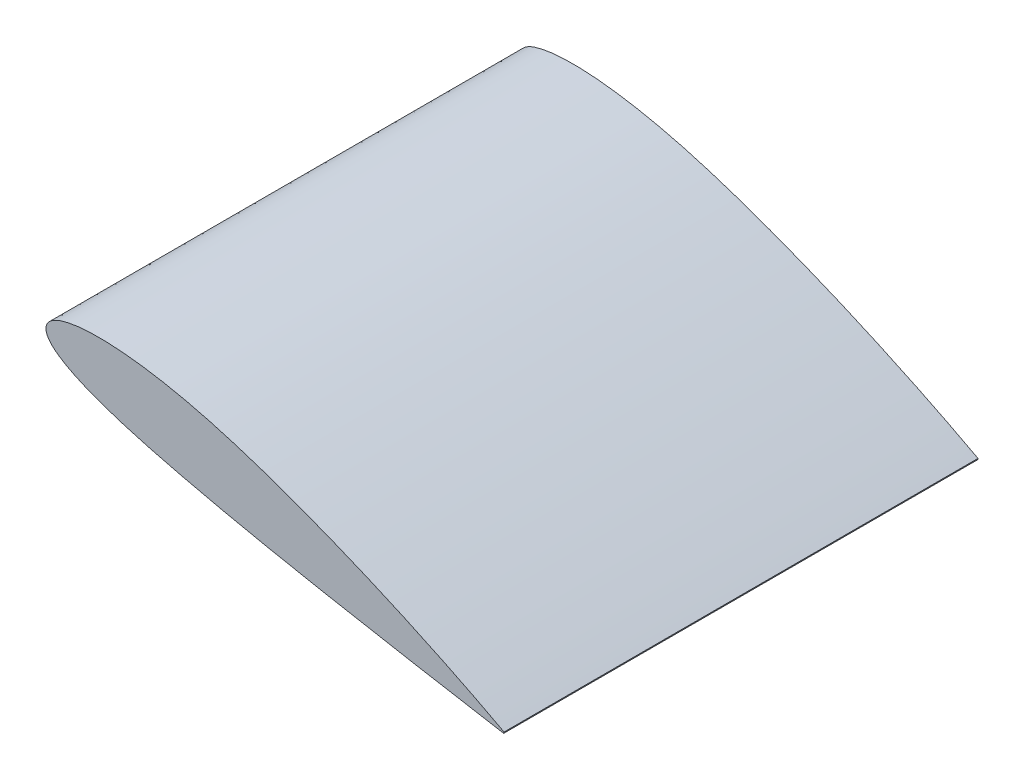
ISO-10303-21;
HEADER;
FILE_DESCRIPTION(('STEP AP214'),'2;1');
FILE_NAME('part.step','',(''),(''),'','','');
FILE_SCHEMA(('AUTOMOTIVE_DESIGN { 1 0 10303 214 1 1 1 1 }'));
ENDSEC;
DATA;
#1=APPLICATION_CONTEXT('core data for automotive mechanical design processes');
#2=APPLICATION_PROTOCOL_DEFINITION('international standard','automotive_design',2000,#1);
#3=PRODUCT_CONTEXT('',#1,'mechanical');
#4=PRODUCT('Part','Part','',(#3));
#5=PRODUCT_RELATED_PRODUCT_CATEGORY('part','',(#4));
#6=PRODUCT_DEFINITION_FORMATION('','',#4);
#7=PRODUCT_DEFINITION_CONTEXT('part definition',#1,'design');
#8=PRODUCT_DEFINITION('design','',#6,#7);
#9=PRODUCT_DEFINITION_SHAPE('','',#8);
#10=(LENGTH_UNIT() NAMED_UNIT(*) SI_UNIT(.MILLI.,.METRE.));
#11=(NAMED_UNIT(*) PLANE_ANGLE_UNIT() SI_UNIT($,.RADIAN.));
#12=(NAMED_UNIT(*) SI_UNIT($,.STERADIAN.) SOLID_ANGLE_UNIT());
#13=UNCERTAINTY_MEASURE_WITH_UNIT(LENGTH_MEASURE(1.E-05),#10,'distance_accuracy_value','');
#14=(GEOMETRIC_REPRESENTATION_CONTEXT(3) GLOBAL_UNCERTAINTY_ASSIGNED_CONTEXT((#13)) GLOBAL_UNIT_ASSIGNED_CONTEXT((#10,
#11,#12)) REPRESENTATION_CONTEXT('',''));
#15=CARTESIAN_POINT('',(0.,0.,0.));
#16=DIRECTION('',(0.,0.,1.));
#17=DIRECTION('',(1.,0.,0.));
#18=AXIS2_PLACEMENT_3D('',#15,#16,#17);
#19=CARTESIAN_POINT('',(500.380463996301,0.684910964644954,500.));
#20=CARTESIAN_POINT('',(499.9877618964,0.899476741979179,500.));
#21=CARTESIAN_POINT('',(498.379520002359,1.77819287877607,500.));
#22=CARTESIAN_POINT('',(494.724795459019,3.69339888968124,500.));
#23=CARTESIAN_POINT('',(488.668576117749,6.89473311279851,500.));
#24=CARTESIAN_POINT('',(480.253931871656,11.2693786013335,500.));
#25=CARTESIAN_POINT('',(469.572425637167,16.754502219723,500.));
#26=CARTESIAN_POINT('',(451.124700389354,26.0350933232045,500.));
#27=CARTESIAN_POINT('',(423.330265585062,39.5479179549738,500.));
#28=CARTESIAN_POINT('',(385.020236461234,57.2211427320324,500.));
#29=CARTESIAN_POINT('',(349.324231508166,72.6684479983427,500.));
#30=CARTESIAN_POINT('',(318.470794533771,85.2640702799098,500.));
#31=CARTESIAN_POINT('',(294.236154178482,94.739860643041,500.));
#32=CARTESIAN_POINT('',(269.581372847869,103.882526411277,500.));
#33=CARTESIAN_POINT('',(244.769860079252,112.56278107854,500.));
#34=CARTESIAN_POINT('',(219.993165082434,120.660650274886,500.));
#35=CARTESIAN_POINT('',(195.478965564054,127.907059723247,500.));
#36=CARTESIAN_POINT('',(171.487528336489,134.109047714543,500.));
#37=CARTESIAN_POINT('',(148.380181625974,139.184804352151,500.));
#38=CARTESIAN_POINT('',(126.430423416033,143.078422896195,500.));
#39=CARTESIAN_POINT('',(105.905312395121,145.788264466767,500.));
#40=CARTESIAN_POINT('',(87.0506403358911,147.299335084303,500.));
#41=CARTESIAN_POINT('',(70.0988614434825,147.683325605259,500.));
#42=CARTESIAN_POINT('',(55.2515724940028,146.986744575518,500.));
#43=CARTESIAN_POINT('',(42.6734428136375,145.312356719623,500.));
#44=CARTESIAN_POINT('',(32.4722091227457,142.737894506984,500.));
#45=CARTESIAN_POINT('',(24.7042670223328,139.32427240949,500.));
#46=CARTESIAN_POINT('',(19.3074252645258,134.987872262996,500.));
#47=CARTESIAN_POINT('',(16.7100941128866,129.467983342564,500.));
#48=CARTESIAN_POINT('',(17.4090111461147,123.419135392076,500.));
#49=CARTESIAN_POINT('',(21.0762841823266,117.590462904188,500.));
#50=CARTESIAN_POINT('',(27.212420899173,111.851854761809,500.));
#51=CARTESIAN_POINT('',(35.7912023833257,106.038418862578,500.));
#52=CARTESIAN_POINT('',(46.7650835700481,100.1760740178,500.));
#53=CARTESIAN_POINT('',(60.0355956372236,94.305073489301,500.));
#54=CARTESIAN_POINT('',(75.4576556821559,88.457417989138,500.));
#55=CARTESIAN_POINT('',(92.8710436286668,82.6769971294477,500.));
#56=CARTESIAN_POINT('',(112.084328552323,76.980504071494,500.));
#57=CARTESIAN_POINT('',(132.888183707331,71.3638384579801,500.));
#58=CARTESIAN_POINT('',(155.060073333998,65.8351938638476,500.));
#59=CARTESIAN_POINT('',(178.357035662571,60.3662763110714,500.));
#60=CARTESIAN_POINT('',(202.597404221718,54.9149182991759,500.));
#61=CARTESIAN_POINT('',(227.527923513718,49.5060808626651,500.));
#62=CARTESIAN_POINT('',(252.90639324286,44.2946529519917,500.));
#63=CARTESIAN_POINT('',(278.366510634046,39.269195211898,500.));
#64=CARTESIAN_POINT('',(311.620345136114,32.8751013895911,500.));
#65=CARTESIAN_POINT('',(351.272117200652,25.518036322271,500.));
#66=CARTESIAN_POINT('',(389.20285516273,18.6310226698339,500.));
#67=CARTESIAN_POINT('',(422.40927956798,12.7069066394933,500.));
#68=CARTESIAN_POINT('',(445.437633812483,8.63488902573986,500.));
#69=CARTESIAN_POINT('',(465.708003926122,5.12199405182604,500.));
#70=CARTESIAN_POINT('',(477.51300787772,3.08355855049455,500.));
#71=CARTESIAN_POINT('',(486.845699898416,1.4942803337891,500.));
#72=CARTESIAN_POINT('',(493.590102545309,0.344727074667553,500.));
#73=CARTESIAN_POINT('',(497.689473289247,-0.333235063381777,500.));
#74=CARTESIAN_POINT('',(499.526807280182,-0.65271908881152,500.));
#75=CARTESIAN_POINT('',(500.,-0.734999999999972,500.));
#76=B_SPLINE_CURVE_WITH_KNOTS('',3,(#19,#20,#21,#22,#23,#24,#25,#26,#27,#28,#29,#30,#31,#32,#33,
#34,#35,#36,#37,#38,#39,#40,#41,#42,#43,#44,#45,#46,#47,#48,#49,#50,#51,#52,#53,#54,#55,#56,#57,
#58,#59,#60,#61,#62,#63,#64,#65,#66,#67,#68,#69,#70,#71,#72,#73,#74,#75),.UNSPECIFIED.,.F.,.F.,
(4,1,1,1,1,1,1,1,1,1,1,1,1,1,1,1,1,1,1,1,1,1,1,1,1,1,1,1,1,1,1,1,1,1,1,1,1,1,1,1,1,1,1,1,1,1,1,
1,1,1,1,1,1,1,4),(0.,0.00130837081542839,0.00535820093360155,0.0120634085253878,
0.0213373007121304,0.0330866187411575,0.0471706431167192,0.0817143521603722,0.123442225424641,
0.170516869891991,0.195424313078073,0.220875125128334,0.246594093158621,0.27230183119837,
0.297725323194622,0.322799376279139,0.347028843152348,0.370161526826169,0.391953614266856,
0.412187725503294,0.430670139078719,0.447230521373444,0.461731544762895,0.474085211958424,
0.484275746782023,0.492391838666874,0.498749378071359,0.504100298021388,0.509453028247956,
0.515789796667128,0.523837665507612,0.533884867180463,0.546005346930758,0.560170801963068,
0.576284399119538,0.59421119075826,0.613803378609794,0.63486930365632,0.657209967038878,
0.680611018884909,0.704834651870993,0.729852897081449,0.755196950720251,0.780582678334603,
0.80572855379656,0.854204496729438,0.898493682913272,0.918442716247676,0.952825660165467,
0.966867903961449,0.97859219917356,0.987851654270917,0.994547443989921,0.998595731738975,1.),.UNSPECIFIED.);
#77=DIRECTION('',(0.,0.,-1.));
#78=VECTOR('',#77,1.);
#79=SURFACE_OF_LINEAR_EXTRUSION('',#76,#78);
#80=CARTESIAN_POINT('',(500.380463996301,0.684910964644954,0.));
#81=CARTESIAN_POINT('',(499.9877618964,0.899476741979179,0.));
#82=CARTESIAN_POINT('',(498.379520002359,1.77819287877607,0.));
#83=CARTESIAN_POINT('',(494.724795459019,3.69339888968124,0.));
#84=CARTESIAN_POINT('',(488.668576117749,6.89473311279851,0.));
#85=CARTESIAN_POINT('',(480.253931871656,11.2693786013335,0.));
#86=CARTESIAN_POINT('',(469.572425637167,16.754502219723,0.));
#87=CARTESIAN_POINT('',(451.124700389354,26.0350933232045,0.));
#88=CARTESIAN_POINT('',(423.330265585062,39.5479179549738,0.));
#89=CARTESIAN_POINT('',(385.020236461234,57.2211427320324,0.));
#90=CARTESIAN_POINT('',(349.324231508166,72.6684479983427,0.));
#91=CARTESIAN_POINT('',(318.470794533771,85.2640702799098,0.));
#92=CARTESIAN_POINT('',(294.236154178482,94.739860643041,0.));
#93=CARTESIAN_POINT('',(269.581372847869,103.882526411277,0.));
#94=CARTESIAN_POINT('',(244.769860079252,112.56278107854,0.));
#95=CARTESIAN_POINT('',(219.993165082434,120.660650274886,0.));
#96=CARTESIAN_POINT('',(195.478965564054,127.907059723247,0.));
#97=CARTESIAN_POINT('',(171.487528336489,134.109047714543,0.));
#98=CARTESIAN_POINT('',(148.380181625974,139.184804352151,0.));
#99=CARTESIAN_POINT('',(126.430423416033,143.078422896195,0.));
#100=CARTESIAN_POINT('',(105.905312395121,145.788264466767,0.));
#101=CARTESIAN_POINT('',(87.0506403358911,147.299335084303,0.));
#102=CARTESIAN_POINT('',(70.0988614434825,147.683325605259,0.));
#103=CARTESIAN_POINT('',(55.2515724940028,146.986744575518,0.));
#104=CARTESIAN_POINT('',(42.6734428136375,145.312356719623,0.));
#105=CARTESIAN_POINT('',(32.4722091227457,142.737894506984,0.));
#106=CARTESIAN_POINT('',(24.7042670223328,139.32427240949,0.));
#107=CARTESIAN_POINT('',(19.3074252645258,134.987872262996,0.));
#108=CARTESIAN_POINT('',(16.7100941128866,129.467983342564,0.));
#109=CARTESIAN_POINT('',(17.4090111461147,123.419135392076,0.));
#110=CARTESIAN_POINT('',(21.0762841823266,117.590462904188,0.));
#111=CARTESIAN_POINT('',(27.212420899173,111.851854761809,0.));
#112=CARTESIAN_POINT('',(35.7912023833257,106.038418862578,0.));
#113=CARTESIAN_POINT('',(46.7650835700481,100.1760740178,0.));
#114=CARTESIAN_POINT('',(60.0355956372236,94.305073489301,0.));
#115=CARTESIAN_POINT('',(75.4576556821559,88.457417989138,0.));
#116=CARTESIAN_POINT('',(92.8710436286668,82.6769971294477,0.));
#117=CARTESIAN_POINT('',(112.084328552323,76.980504071494,0.));
#118=CARTESIAN_POINT('',(132.888183707331,71.3638384579801,0.));
#119=CARTESIAN_POINT('',(155.060073333998,65.8351938638476,0.));
#120=CARTESIAN_POINT('',(178.357035662571,60.3662763110714,0.));
#121=CARTESIAN_POINT('',(202.597404221718,54.9149182991759,0.));
#122=CARTESIAN_POINT('',(227.527923513718,49.5060808626651,0.));
#123=CARTESIAN_POINT('',(252.90639324286,44.2946529519917,0.));
#124=CARTESIAN_POINT('',(278.366510634046,39.269195211898,0.));
#125=CARTESIAN_POINT('',(311.620345136114,32.8751013895911,0.));
#126=CARTESIAN_POINT('',(351.272117200652,25.518036322271,0.));
#127=CARTESIAN_POINT('',(389.20285516273,18.6310226698339,0.));
#128=CARTESIAN_POINT('',(422.40927956798,12.7069066394933,0.));
#129=CARTESIAN_POINT('',(445.437633812483,8.63488902573986,0.));
#130=CARTESIAN_POINT('',(465.708003926122,5.12199405182604,0.));
#131=CARTESIAN_POINT('',(477.51300787772,3.08355855049455,0.));
#132=CARTESIAN_POINT('',(486.845699898416,1.4942803337891,0.));
#133=CARTESIAN_POINT('',(493.590102545309,0.344727074667553,0.));
#134=CARTESIAN_POINT('',(497.689473289247,-0.333235063381777,0.));
#135=CARTESIAN_POINT('',(499.526807280182,-0.65271908881152,0.));
#136=CARTESIAN_POINT('',(500.,-0.734999999999972,0.));
#137=B_SPLINE_CURVE_WITH_KNOTS('',3,(#80,#81,#82,#83,#84,#85,#86,#87,#88,#89,#90,#91,#92,#93,
#94,#95,#96,#97,#98,#99,#100,#101,#102,#103,#104,#105,#106,#107,#108,#109,#110,#111,#112,#113,
#114,#115,#116,#117,#118,#119,#120,#121,#122,#123,#124,#125,#126,#127,#128,#129,#130,#131,#132,
#133,#134,#135,#136),.UNSPECIFIED.,.F.,.F.,(4,1,1,1,1,1,1,1,1,1,1,1,1,1,1,1,1,1,1,1,1,1,1,1,1,1,
1,1,1,1,1,1,1,1,1,1,1,1,1,1,1,1,1,1,1,1,1,1,1,1,1,1,1,1,4),(0.,0.00130837081542839,
0.00535820093360155,0.0120634085253878,0.0213373007121304,0.0330866187411575,0.0471706431167192,
0.0817143521603722,0.123442225424641,0.170516869891991,0.195424313078073,0.220875125128334,
0.246594093158621,0.27230183119837,0.297725323194622,0.322799376279139,0.347028843152348,
0.370161526826169,0.391953614266856,0.412187725503294,0.430670139078719,0.447230521373444,
0.461731544762895,0.474085211958424,0.484275746782023,0.492391838666874,0.498749378071359,
0.504100298021388,0.509453028247956,0.515789796667128,0.523837665507612,0.533884867180463,
0.546005346930758,0.560170801963068,0.576284399119538,0.59421119075826,0.613803378609794,
0.63486930365632,0.657209967038878,0.680611018884909,0.704834651870993,0.729852897081449,
0.755196950720251,0.780582678334603,0.80572855379656,0.854204496729438,0.898493682913272,
0.918442716247676,0.952825660165467,0.966867903961449,0.97859219917356,0.987851654270917,
0.994547443989921,0.998595731738975,1.),.UNSPECIFIED.);
#138=CARTESIAN_POINT('',(500.380463996301,0.684910964644954,0.));
#139=VERTEX_POINT('',#138);
#140=CARTESIAN_POINT('',(500.,-0.734999999999972,0.));
#141=VERTEX_POINT('',#140);
#142=EDGE_CURVE('E81',#139,#141,#137,.T.);
#143=ORIENTED_EDGE('',*,*,#142,.T.);
#144=DIRECTION('',(0.,0.,-1.));
#145=VECTOR('',#144,1.);
#146=CARTESIAN_POINT('',(500.,-0.734999999999972,500.));
#147=LINE('',#146,#145);
#148=CARTESIAN_POINT('',(500.,-0.734999999999972,500.));
#149=VERTEX_POINT('',#148);
#150=EDGE_CURVE('E12',#149,#141,#147,.T.);
#151=ORIENTED_EDGE('',*,*,#150,.F.);
#152=CARTESIAN_POINT('',(500.380463996301,0.684910964644954,500.));
#153=VERTEX_POINT('',#152);
#154=EDGE_CURVE('E80',#153,#149,#76,.T.);
#155=ORIENTED_EDGE('',*,*,#154,.F.);
#156=DIRECTION('',(0.,0.,-1.));
#157=VECTOR('',#156,1.);
#158=CARTESIAN_POINT('',(500.380463996301,0.684910964644954,500.));
#159=LINE('',#158,#157);
#160=EDGE_CURVE('E57',#153,#139,#159,.T.);
#161=ORIENTED_EDGE('',*,*,#160,.T.);
#162=EDGE_LOOP('',(#143,#151,#155,#161));
#163=FACE_BOUND('',#162,.T.);
#164=ADVANCED_FACE('F46',(#163),#79,.F.);
#165=CARTESIAN_POINT('',(500.,-0.734999999999972,500.));
#166=DIRECTION('',(-0.965925826289077,0.258819045102487,0.));
#167=DIRECTION('',(-0.258819045102487,-0.965925826289077,0.));
#168=AXIS2_PLACEMENT_3D('',#165,#166,#167);
#169=PLANE('',#168);
#170=DIRECTION('',(0.258819045102487,0.965925826289077,0.));
#171=VECTOR('',#170,1.);
#172=CARTESIAN_POINT('',(500.,-0.734999999999972,0.));
#173=LINE('',#172,#171);
#174=EDGE_CURVE('E72',#141,#139,#173,.T.);
#175=ORIENTED_EDGE('',*,*,#174,.T.);
#176=ORIENTED_EDGE('',*,*,#160,.F.);
#177=DIRECTION('',(0.258819045102487,0.965925826289077,0.));
#178=VECTOR('',#177,1.);
#179=CARTESIAN_POINT('',(500.,-0.734999999999972,500.));
#180=LINE('',#179,#178);
#181=EDGE_CURVE('E64',#149,#153,#180,.T.);
#182=ORIENTED_EDGE('',*,*,#181,.F.);
#183=ORIENTED_EDGE('',*,*,#150,.T.);
#184=EDGE_LOOP('',(#175,#176,#182,#183));
#185=FACE_BOUND('',#184,.T.);
#186=ADVANCED_FACE('F75',(#185),#169,.F.);
#187=CARTESIAN_POINT('',(18.721642860274,133.331954173163,500.));
#188=DIRECTION('',(0.,0.,-1.));
#189=DIRECTION('',(-1.,0.,0.));
#190=AXIS2_PLACEMENT_3D('',#187,#188,#189);
#191=PLANE('',#190);
#192=ORIENTED_EDGE('',*,*,#154,.T.);
#193=ORIENTED_EDGE('',*,*,#181,.T.);
#194=EDGE_LOOP('',(#192,#193));
#195=FACE_BOUND('',#194,.T.);
#196=ADVANCED_FACE('F123',(#195),#191,.F.);
#197=CARTESIAN_POINT('',(18.721642860274,133.331954173163,0.));
#198=DIRECTION('',(0.,0.,-1.));
#199=DIRECTION('',(-1.,0.,0.));
#200=AXIS2_PLACEMENT_3D('',#197,#198,#199);
#201=PLANE('',#200);
#202=ORIENTED_EDGE('',*,*,#142,.F.);
#203=ORIENTED_EDGE('',*,*,#174,.F.);
#204=EDGE_LOOP('',(#202,#203));
#205=FACE_BOUND('',#204,.T.);
#206=ADVANCED_FACE('F85',(#205),#201,.T.);
#207=CLOSED_SHELL('',(#164,#186,#196,#206));
#208=MANIFOLD_SOLID_BREP('B2',#207);
#209=ADVANCED_BREP_SHAPE_REPRESENTATION('',(#18,#208),#14);
#210=SHAPE_DEFINITION_REPRESENTATION(#9,#209);
ENDSEC;
END-ISO-10303-21;
